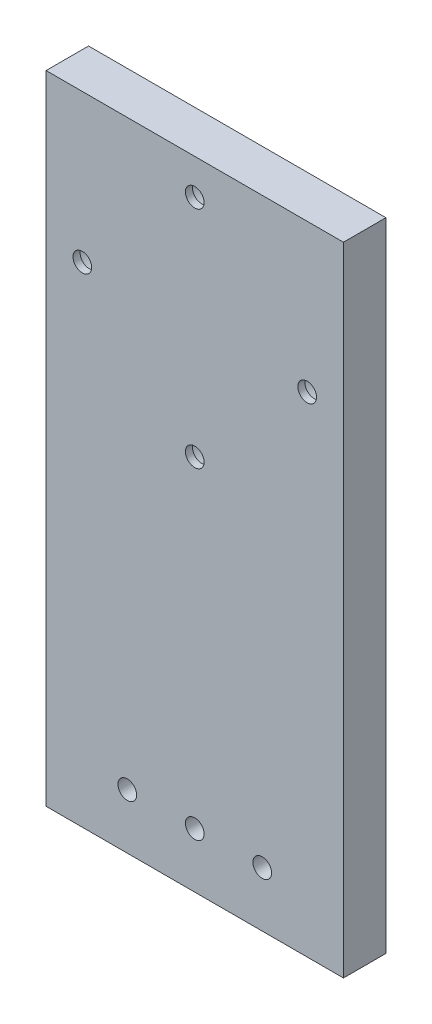
ISO-10303-21;
HEADER;
FILE_DESCRIPTION(('STEP AP214'),'2;1');
FILE_NAME('part.step','',(''),(''),'','','');
FILE_SCHEMA(('AUTOMOTIVE_DESIGN { 1 0 10303 214 1 1 1 1 }'));
ENDSEC;
DATA;
#1=APPLICATION_CONTEXT('core data for automotive mechanical design processes');
#2=APPLICATION_PROTOCOL_DEFINITION('international standard','automotive_design',2000,#1);
#3=PRODUCT_CONTEXT('',#1,'mechanical');
#4=PRODUCT('Part','Part','',(#3));
#5=PRODUCT_RELATED_PRODUCT_CATEGORY('part','',(#4));
#6=PRODUCT_DEFINITION_FORMATION('','',#4);
#7=PRODUCT_DEFINITION_CONTEXT('part definition',#1,'design');
#8=PRODUCT_DEFINITION('design','',#6,#7);
#9=PRODUCT_DEFINITION_SHAPE('','',#8);
#10=(LENGTH_UNIT() NAMED_UNIT(*) SI_UNIT(.MILLI.,.METRE.));
#11=(NAMED_UNIT(*) PLANE_ANGLE_UNIT() SI_UNIT($,.RADIAN.));
#12=(NAMED_UNIT(*) SI_UNIT($,.STERADIAN.) SOLID_ANGLE_UNIT());
#13=UNCERTAINTY_MEASURE_WITH_UNIT(LENGTH_MEASURE(1.E-05),#10,'distance_accuracy_value','');
#14=(GEOMETRIC_REPRESENTATION_CONTEXT(3) GLOBAL_UNCERTAINTY_ASSIGNED_CONTEXT((#13)) GLOBAL_UNIT_ASSIGNED_CONTEXT((#10,
#11,#12)) REPRESENTATION_CONTEXT('',''));
#15=CARTESIAN_POINT('',(0.,0.,0.));
#16=DIRECTION('',(0.,0.,1.));
#17=DIRECTION('',(1.,0.,0.));
#18=AXIS2_PLACEMENT_3D('',#15,#16,#17);
#19=CARTESIAN_POINT('',(0.,-15.875,6.));
#20=DIRECTION('',(0.,0.,-1.));
#21=DIRECTION('',(-1.,0.,0.));
#22=AXIS2_PLACEMENT_3D('',#19,#20,#21);
#23=CYLINDRICAL_SURFACE('',#22,1.32);
#24=CARTESIAN_POINT('',(0.,-15.875,6.));
#25=DIRECTION('',(0.,0.,1.));
#26=DIRECTION('',(1.,0.,0.));
#27=AXIS2_PLACEMENT_3D('',#24,#25,#26);
#28=CIRCLE('',#27,1.32);
#29=CARTESIAN_POINT('',(1.32,-15.875,6.));
#30=VERTEX_POINT('',#29);
#31=EDGE_CURVE('E104',#30,#30,#28,.T.);
#32=ORIENTED_EDGE('',*,*,#31,.T.);
#33=EDGE_LOOP('',(#32));
#34=FACE_BOUND('',#33,.T.);
#35=CARTESIAN_POINT('',(0.,-15.875,5.));
#36=DIRECTION('',(0.,0.,-1.));
#37=DIRECTION('',(-1.,0.,0.));
#38=AXIS2_PLACEMENT_3D('',#35,#36,#37);
#39=CIRCLE('',#38,1.32);
#40=CARTESIAN_POINT('',(-1.32,-15.875,5.));
#41=VERTEX_POINT('',#40);
#42=EDGE_CURVE('E37',#41,#41,#39,.T.);
#43=ORIENTED_EDGE('',*,*,#42,.T.);
#44=EDGE_LOOP('',(#43));
#45=FACE_BOUND('',#44,.T.);
#46=ADVANCED_FACE('F33',(#34,#45),#23,.F.);
#47=CARTESIAN_POINT('',(-15.875,0.,6.));
#48=DIRECTION('',(0.,0.,-1.));
#49=DIRECTION('',(-1.,0.,0.));
#50=AXIS2_PLACEMENT_3D('',#47,#48,#49);
#51=CYLINDRICAL_SURFACE('',#50,1.31999999999995);
#52=CARTESIAN_POINT('',(-15.875,0.,6.));
#53=DIRECTION('',(0.,0.,1.));
#54=DIRECTION('',(1.,0.,0.));
#55=AXIS2_PLACEMENT_3D('',#52,#53,#54);
#56=CIRCLE('',#55,1.31999999999995);
#57=CARTESIAN_POINT('',(-14.5550000000001,0.,6.));
#58=VERTEX_POINT('',#57);
#59=EDGE_CURVE('E161',#58,#58,#56,.T.);
#60=ORIENTED_EDGE('',*,*,#59,.T.);
#61=EDGE_LOOP('',(#60));
#62=FACE_BOUND('',#61,.T.);
#63=CARTESIAN_POINT('',(-15.875,0.,5.));
#64=DIRECTION('',(0.,0.,-1.));
#65=DIRECTION('',(-1.,0.,0.));
#66=AXIS2_PLACEMENT_3D('',#63,#64,#65);
#67=CIRCLE('',#66,1.31999999999995);
#68=CARTESIAN_POINT('',(-17.1949999999999,0.,5.));
#69=VERTEX_POINT('',#68);
#70=EDGE_CURVE('E119',#69,#69,#67,.T.);
#71=ORIENTED_EDGE('',*,*,#70,.T.);
#72=EDGE_LOOP('',(#71));
#73=FACE_BOUND('',#72,.T.);
#74=ADVANCED_FACE('F205',(#62,#73),#51,.F.);
#75=CARTESIAN_POINT('',(1.08910405714623E-13,15.875,6.));
#76=DIRECTION('',(0.,0.,-1.));
#77=DIRECTION('',(-1.,0.,0.));
#78=AXIS2_PLACEMENT_3D('',#75,#76,#77);
#79=CYLINDRICAL_SURFACE('',#78,1.32);
#80=CARTESIAN_POINT('',(1.08910405714623E-13,15.875,6.));
#81=DIRECTION('',(0.,0.,1.));
#82=DIRECTION('',(1.,0.,0.));
#83=AXIS2_PLACEMENT_3D('',#80,#81,#82);
#84=CIRCLE('',#83,1.32);
#85=CARTESIAN_POINT('',(1.32000000000011,15.875,6.));
#86=VERTEX_POINT('',#85);
#87=EDGE_CURVE('E158',#86,#86,#84,.T.);
#88=ORIENTED_EDGE('',*,*,#87,.T.);
#89=EDGE_LOOP('',(#88));
#90=FACE_BOUND('',#89,.T.);
#91=CARTESIAN_POINT('',(1.08910405714623E-13,15.875,5.));
#92=DIRECTION('',(0.,0.,-1.));
#93=DIRECTION('',(-1.,0.,0.));
#94=AXIS2_PLACEMENT_3D('',#91,#92,#93);
#95=CIRCLE('',#94,1.32);
#96=CARTESIAN_POINT('',(-1.31999999999989,15.875,5.));
#97=VERTEX_POINT('',#96);
#98=EDGE_CURVE('E115',#97,#97,#95,.T.);
#99=ORIENTED_EDGE('',*,*,#98,.T.);
#100=EDGE_LOOP('',(#99));
#101=FACE_BOUND('',#100,.T.);
#102=ADVANCED_FACE('F210',(#90,#101),#79,.F.);
#103=CARTESIAN_POINT('',(15.875,0.,6.));
#104=DIRECTION('',(0.,0.,-1.));
#105=DIRECTION('',(-1.,0.,0.));
#106=AXIS2_PLACEMENT_3D('',#103,#104,#105);
#107=CYLINDRICAL_SURFACE('',#106,1.31999999999984);
#108=CARTESIAN_POINT('',(15.875,0.,6.));
#109=DIRECTION('',(0.,0.,1.));
#110=DIRECTION('',(1.,0.,0.));
#111=AXIS2_PLACEMENT_3D('',#108,#109,#110);
#112=CIRCLE('',#111,1.31999999999984);
#113=CARTESIAN_POINT('',(17.1949999999998,0.,6.));
#114=VERTEX_POINT('',#113);
#115=EDGE_CURVE('E153',#114,#114,#112,.T.);
#116=ORIENTED_EDGE('',*,*,#115,.T.);
#117=EDGE_LOOP('',(#116));
#118=FACE_BOUND('',#117,.T.);
#119=CARTESIAN_POINT('',(15.875,0.,5.));
#120=DIRECTION('',(0.,0.,-1.));
#121=DIRECTION('',(-1.,0.,0.));
#122=AXIS2_PLACEMENT_3D('',#119,#120,#121);
#123=CIRCLE('',#122,1.31999999999984);
#124=CARTESIAN_POINT('',(14.5550000000002,0.,5.));
#125=VERTEX_POINT('',#124);
#126=EDGE_CURVE('E110',#125,#125,#123,.T.);
#127=ORIENTED_EDGE('',*,*,#126,.T.);
#128=EDGE_LOOP('',(#127));
#129=FACE_BOUND('',#128,.T.);
#130=ADVANCED_FACE('F177',(#118,#129),#107,.F.);
#131=CARTESIAN_POINT('',(0.,0.,6.));
#132=DIRECTION('',(0.,0.,1.));
#133=DIRECTION('',(1.,0.,0.));
#134=AXIS2_PLACEMENT_3D('',#131,#132,#133);
#135=PLANE('',#134);
#136=CARTESIAN_POINT('',(0.,-61.35,6.));
#137=DIRECTION('',(0.,0.,1.));
#138=DIRECTION('',(1.,0.,0.));
#139=AXIS2_PLACEMENT_3D('',#136,#137,#138);
#140=CIRCLE('',#139,1.32);
#141=CARTESIAN_POINT('',(1.32,-61.35,6.));
#142=VERTEX_POINT('',#141);
#143=EDGE_CURVE('E150',#142,#142,#140,.T.);
#144=ORIENTED_EDGE('',*,*,#143,.F.);
#145=EDGE_LOOP('',(#144));
#146=FACE_BOUND('',#145,.T.);
#147=ORIENTED_EDGE('',*,*,#87,.F.);
#148=EDGE_LOOP('',(#147));
#149=FACE_BOUND('',#148,.T.);
#150=CARTESIAN_POINT('',(-9.52999999999999,-61.35,6.));
#151=DIRECTION('',(0.,0.,1.));
#152=DIRECTION('',(1.,0.,0.));
#153=AXIS2_PLACEMENT_3D('',#150,#151,#152);
#154=CIRCLE('',#153,1.32);
#155=CARTESIAN_POINT('',(-8.20999999999999,-61.35,6.));
#156=VERTEX_POINT('',#155);
#157=EDGE_CURVE('E165',#156,#156,#154,.T.);
#158=ORIENTED_EDGE('',*,*,#157,.F.);
#159=EDGE_LOOP('',(#158));
#160=FACE_BOUND('',#159,.T.);
#161=DIRECTION('',(0.,-1.,0.));
#162=VECTOR('',#161,1.);
#163=CARTESIAN_POINT('',(-21.,20.875,6.));
#164=LINE('',#163,#162);
#165=CARTESIAN_POINT('',(-21.,20.875,6.));
#166=VERTEX_POINT('',#165);
#167=CARTESIAN_POINT('',(-21.,-69.125,6.));
#168=VERTEX_POINT('',#167);
#169=EDGE_CURVE('E88',#166,#168,#164,.T.);
#170=ORIENTED_EDGE('',*,*,#169,.T.);
#171=DIRECTION('',(1.,0.,0.));
#172=VECTOR('',#171,1.);
#173=CARTESIAN_POINT('',(-21.,-69.125,6.));
#174=LINE('',#173,#172);
#175=CARTESIAN_POINT('',(21.,-69.125,6.));
#176=VERTEX_POINT('',#175);
#177=EDGE_CURVE('E82',#168,#176,#174,.T.);
#178=ORIENTED_EDGE('',*,*,#177,.T.);
#179=DIRECTION('',(0.,1.,0.));
#180=VECTOR('',#179,1.);
#181=CARTESIAN_POINT('',(21.,20.875,6.));
#182=LINE('',#181,#180);
#183=CARTESIAN_POINT('',(21.,20.875,6.));
#184=VERTEX_POINT('',#183);
#185=EDGE_CURVE('E86',#176,#184,#182,.T.);
#186=ORIENTED_EDGE('',*,*,#185,.T.);
#187=DIRECTION('',(-1.,0.,0.));
#188=VECTOR('',#187,1.);
#189=CARTESIAN_POINT('',(-21.,20.875,6.));
#190=LINE('',#189,#188);
#191=EDGE_CURVE('E52',#184,#166,#190,.T.);
#192=ORIENTED_EDGE('',*,*,#191,.T.);
#193=EDGE_LOOP('',(#170,#178,#186,#192));
#194=FACE_BOUND('',#193,.T.);
#195=ORIENTED_EDGE('',*,*,#31,.F.);
#196=EDGE_LOOP('',(#195));
#197=FACE_BOUND('',#196,.T.);
#198=ORIENTED_EDGE('',*,*,#59,.F.);
#199=EDGE_LOOP('',(#198));
#200=FACE_BOUND('',#199,.T.);
#201=ORIENTED_EDGE('',*,*,#115,.F.);
#202=EDGE_LOOP('',(#201));
#203=FACE_BOUND('',#202,.T.);
#204=CARTESIAN_POINT('',(9.53,-61.35,6.));
#205=DIRECTION('',(0.,0.,1.));
#206=DIRECTION('',(1.,0.,0.));
#207=AXIS2_PLACEMENT_3D('',#204,#205,#206);
#208=CIRCLE('',#207,1.32);
#209=CARTESIAN_POINT('',(10.85,-61.35,6.));
#210=VERTEX_POINT('',#209);
#211=EDGE_CURVE('E144',#210,#210,#208,.T.);
#212=ORIENTED_EDGE('',*,*,#211,.F.);
#213=EDGE_LOOP('',(#212));
#214=FACE_BOUND('',#213,.T.);
#215=ADVANCED_FACE('F83',(#146,#149,#160,#194,#197,#200,#203,#214),#135,.T.);
#216=CARTESIAN_POINT('',(0.,0.,0.));
#217=DIRECTION('',(0.,0.,1.));
#218=DIRECTION('',(1.,0.,0.));
#219=AXIS2_PLACEMENT_3D('',#216,#217,#218);
#220=PLANE('',#219);
#221=CARTESIAN_POINT('',(0.,-15.8749999999999,0.));
#222=DIRECTION('',(0.,0.,-1.));
#223=DIRECTION('',(-1.,0.,0.));
#224=AXIS2_PLACEMENT_3D('',#221,#222,#223);
#225=CIRCLE('',#224,3.25);
#226=CARTESIAN_POINT('',(-3.24999999999999,-15.8749999999999,0.));
#227=VERTEX_POINT('',#226);
#228=EDGE_CURVE('E135',#227,#227,#225,.T.);
#229=ORIENTED_EDGE('',*,*,#228,.F.);
#230=EDGE_LOOP('',(#229));
#231=FACE_BOUND('',#230,.T.);
#232=CARTESIAN_POINT('',(-15.8749999999999,1.09107160968774E-13,0.));
#233=DIRECTION('',(0.,0.,-1.));
#234=DIRECTION('',(-1.,0.,0.));
#235=AXIS2_PLACEMENT_3D('',#232,#233,#234);
#236=CIRCLE('',#235,3.25);
#237=CARTESIAN_POINT('',(-19.1249999999999,1.09107160968774E-13,0.));
#238=VERTEX_POINT('',#237);
#239=EDGE_CURVE('E128',#238,#238,#236,.T.);
#240=ORIENTED_EDGE('',*,*,#239,.F.);
#241=EDGE_LOOP('',(#240));
#242=FACE_BOUND('',#241,.T.);
#243=CARTESIAN_POINT('',(1.08910405714623E-13,15.875,0.));
#244=DIRECTION('',(0.,0.,-1.));
#245=DIRECTION('',(-1.,0.,0.));
#246=AXIS2_PLACEMENT_3D('',#243,#244,#245);
#247=CIRCLE('',#246,3.25);
#248=CARTESIAN_POINT('',(-3.24999999999989,15.875,0.));
#249=VERTEX_POINT('',#248);
#250=EDGE_CURVE('E121',#249,#249,#247,.T.);
#251=ORIENTED_EDGE('',*,*,#250,.F.);
#252=EDGE_LOOP('',(#251));
#253=FACE_BOUND('',#252,.T.);
#254=CARTESIAN_POINT('',(15.875,0.,0.));
#255=DIRECTION('',(0.,0.,-1.));
#256=DIRECTION('',(-1.,0.,0.));
#257=AXIS2_PLACEMENT_3D('',#254,#255,#256);
#258=CIRCLE('',#257,3.25);
#259=CARTESIAN_POINT('',(12.625,0.,0.));
#260=VERTEX_POINT('',#259);
#261=EDGE_CURVE('E117',#260,#260,#258,.T.);
#262=ORIENTED_EDGE('',*,*,#261,.F.);
#263=EDGE_LOOP('',(#262));
#264=FACE_BOUND('',#263,.T.);
#265=CARTESIAN_POINT('',(0.,-61.35,0.));
#266=DIRECTION('',(0.,0.,1.));
#267=DIRECTION('',(1.,0.,0.));
#268=AXIS2_PLACEMENT_3D('',#265,#266,#267);
#269=CIRCLE('',#268,1.32);
#270=CARTESIAN_POINT('',(1.32,-61.35,0.));
#271=VERTEX_POINT('',#270);
#272=EDGE_CURVE('E147',#271,#271,#269,.T.);
#273=ORIENTED_EDGE('',*,*,#272,.T.);
#274=EDGE_LOOP('',(#273));
#275=FACE_BOUND('',#274,.T.);
#276=CARTESIAN_POINT('',(-9.52999999999999,-61.35,0.));
#277=DIRECTION('',(0.,0.,1.));
#278=DIRECTION('',(1.,0.,0.));
#279=AXIS2_PLACEMENT_3D('',#276,#277,#278);
#280=CIRCLE('',#279,1.32);
#281=CARTESIAN_POINT('',(-8.20999999999999,-61.35,0.));
#282=VERTEX_POINT('',#281);
#283=EDGE_CURVE('E164',#282,#282,#280,.T.);
#284=ORIENTED_EDGE('',*,*,#283,.T.);
#285=EDGE_LOOP('',(#284));
#286=FACE_BOUND('',#285,.T.);
#287=DIRECTION('',(0.,-1.,0.));
#288=VECTOR('',#287,1.);
#289=CARTESIAN_POINT('',(-21.,20.875,0.));
#290=LINE('',#289,#288);
#291=CARTESIAN_POINT('',(-21.,20.875,0.));
#292=VERTEX_POINT('',#291);
#293=CARTESIAN_POINT('',(-21.,-69.125,0.));
#294=VERTEX_POINT('',#293);
#295=EDGE_CURVE('E101',#292,#294,#290,.T.);
#296=ORIENTED_EDGE('',*,*,#295,.F.);
#297=DIRECTION('',(-1.,0.,0.));
#298=VECTOR('',#297,1.);
#299=CARTESIAN_POINT('',(-21.,20.875,0.));
#300=LINE('',#299,#298);
#301=CARTESIAN_POINT('',(21.,20.875,0.));
#302=VERTEX_POINT('',#301);
#303=EDGE_CURVE('E75',#302,#292,#300,.T.);
#304=ORIENTED_EDGE('',*,*,#303,.F.);
#305=DIRECTION('',(0.,1.,0.));
#306=VECTOR('',#305,1.);
#307=CARTESIAN_POINT('',(21.,20.875,0.));
#308=LINE('',#307,#306);
#309=CARTESIAN_POINT('',(21.,-69.125,0.));
#310=VERTEX_POINT('',#309);
#311=EDGE_CURVE('E69',#310,#302,#308,.T.);
#312=ORIENTED_EDGE('',*,*,#311,.F.);
#313=DIRECTION('',(1.,0.,0.));
#314=VECTOR('',#313,1.);
#315=CARTESIAN_POINT('',(-21.,-69.125,0.));
#316=LINE('',#315,#314);
#317=EDGE_CURVE('E92',#294,#310,#316,.T.);
#318=ORIENTED_EDGE('',*,*,#317,.F.);
#319=EDGE_LOOP('',(#296,#304,#312,#318));
#320=FACE_BOUND('',#319,.T.);
#321=CARTESIAN_POINT('',(9.53,-61.35,0.));
#322=DIRECTION('',(0.,0.,1.));
#323=DIRECTION('',(1.,0.,0.));
#324=AXIS2_PLACEMENT_3D('',#321,#322,#323);
#325=CIRCLE('',#324,1.32);
#326=CARTESIAN_POINT('',(10.85,-61.35,0.));
#327=VERTEX_POINT('',#326);
#328=EDGE_CURVE('E113',#327,#327,#325,.T.);
#329=ORIENTED_EDGE('',*,*,#328,.T.);
#330=EDGE_LOOP('',(#329));
#331=FACE_BOUND('',#330,.T.);
#332=ADVANCED_FACE('F176',(#231,#242,#253,#264,#275,#286,#320,#331),#220,.F.);
#333=CARTESIAN_POINT('',(-21.,20.875,6.));
#334=DIRECTION('',(1.,0.,0.));
#335=DIRECTION('',(0.,1.,0.));
#336=AXIS2_PLACEMENT_3D('',#333,#334,#335);
#337=PLANE('',#336);
#338=ORIENTED_EDGE('',*,*,#295,.T.);
#339=DIRECTION('',(0.,0.,-1.));
#340=VECTOR('',#339,1.);
#341=CARTESIAN_POINT('',(-21.,-69.125,6.));
#342=LINE('',#341,#340);
#343=EDGE_CURVE('E11',#168,#294,#342,.T.);
#344=ORIENTED_EDGE('',*,*,#343,.F.);
#345=ORIENTED_EDGE('',*,*,#169,.F.);
#346=DIRECTION('',(0.,0.,-1.));
#347=VECTOR('',#346,1.);
#348=CARTESIAN_POINT('',(-21.,20.875,6.));
#349=LINE('',#348,#347);
#350=EDGE_CURVE('E97',#166,#292,#349,.T.);
#351=ORIENTED_EDGE('',*,*,#350,.T.);
#352=EDGE_LOOP('',(#338,#344,#345,#351));
#353=FACE_BOUND('',#352,.T.);
#354=ADVANCED_FACE('F35',(#353),#337,.F.);
#355=CARTESIAN_POINT('',(-21.,-69.125,6.));
#356=DIRECTION('',(0.,1.,0.));
#357=DIRECTION('',(0.,0.,1.));
#358=AXIS2_PLACEMENT_3D('',#355,#356,#357);
#359=PLANE('',#358);
#360=ORIENTED_EDGE('',*,*,#317,.T.);
#361=DIRECTION('',(0.,0.,-1.));
#362=VECTOR('',#361,1.);
#363=CARTESIAN_POINT('',(21.,-69.125,6.));
#364=LINE('',#363,#362);
#365=EDGE_CURVE('E43',#176,#310,#364,.T.);
#366=ORIENTED_EDGE('',*,*,#365,.F.);
#367=ORIENTED_EDGE('',*,*,#177,.F.);
#368=ORIENTED_EDGE('',*,*,#343,.T.);
#369=EDGE_LOOP('',(#360,#366,#367,#368));
#370=FACE_BOUND('',#369,.T.);
#371=ADVANCED_FACE('F91',(#370),#359,.F.);
#372=CARTESIAN_POINT('',(21.,20.875,6.));
#373=DIRECTION('',(-1.,0.,0.));
#374=DIRECTION('',(0.,-1.,0.));
#375=AXIS2_PLACEMENT_3D('',#372,#373,#374);
#376=PLANE('',#375);
#377=ORIENTED_EDGE('',*,*,#311,.T.);
#378=DIRECTION('',(0.,0.,-1.));
#379=VECTOR('',#378,1.);
#380=CARTESIAN_POINT('',(21.,20.875,6.));
#381=LINE('',#380,#379);
#382=EDGE_CURVE('E93',#184,#302,#381,.T.);
#383=ORIENTED_EDGE('',*,*,#382,.F.);
#384=ORIENTED_EDGE('',*,*,#185,.F.);
#385=ORIENTED_EDGE('',*,*,#365,.T.);
#386=EDGE_LOOP('',(#377,#383,#384,#385));
#387=FACE_BOUND('',#386,.T.);
#388=ADVANCED_FACE('F95',(#387),#376,.F.);
#389=CARTESIAN_POINT('',(-21.,20.875,6.));
#390=DIRECTION('',(0.,-1.,0.));
#391=DIRECTION('',(1.,0.,0.));
#392=AXIS2_PLACEMENT_3D('',#389,#390,#391);
#393=PLANE('',#392);
#394=ORIENTED_EDGE('',*,*,#303,.T.);
#395=ORIENTED_EDGE('',*,*,#350,.F.);
#396=ORIENTED_EDGE('',*,*,#191,.F.);
#397=ORIENTED_EDGE('',*,*,#382,.T.);
#398=EDGE_LOOP('',(#394,#395,#396,#397));
#399=FACE_BOUND('',#398,.T.);
#400=ADVANCED_FACE('F216',(#399),#393,.F.);
#401=CARTESIAN_POINT('',(-9.52999999999999,-61.35,6.));
#402=DIRECTION('',(0.,0.,-1.));
#403=DIRECTION('',(-1.,0.,0.));
#404=AXIS2_PLACEMENT_3D('',#401,#402,#403);
#405=CYLINDRICAL_SURFACE('',#404,1.32);
#406=ORIENTED_EDGE('',*,*,#157,.T.);
#407=EDGE_LOOP('',(#406));
#408=FACE_BOUND('',#407,.T.);
#409=ORIENTED_EDGE('',*,*,#283,.F.);
#410=EDGE_LOOP('',(#409));
#411=FACE_BOUND('',#410,.T.);
#412=ADVANCED_FACE('F214',(#408,#411),#405,.F.);
#413=CARTESIAN_POINT('',(0.,-61.35,6.));
#414=DIRECTION('',(0.,0.,-1.));
#415=DIRECTION('',(-1.,0.,0.));
#416=AXIS2_PLACEMENT_3D('',#413,#414,#415);
#417=CYLINDRICAL_SURFACE('',#416,1.32);
#418=ORIENTED_EDGE('',*,*,#143,.T.);
#419=EDGE_LOOP('',(#418));
#420=FACE_BOUND('',#419,.T.);
#421=ORIENTED_EDGE('',*,*,#272,.F.);
#422=EDGE_LOOP('',(#421));
#423=FACE_BOUND('',#422,.T.);
#424=ADVANCED_FACE('F190',(#420,#423),#417,.F.);
#425=CARTESIAN_POINT('',(9.53,-61.35,6.));
#426=DIRECTION('',(0.,0.,-1.));
#427=DIRECTION('',(-1.,0.,0.));
#428=AXIS2_PLACEMENT_3D('',#425,#426,#427);
#429=CYLINDRICAL_SURFACE('',#428,1.32);
#430=ORIENTED_EDGE('',*,*,#211,.T.);
#431=EDGE_LOOP('',(#430));
#432=FACE_BOUND('',#431,.T.);
#433=ORIENTED_EDGE('',*,*,#328,.F.);
#434=EDGE_LOOP('',(#433));
#435=FACE_BOUND('',#434,.T.);
#436=ADVANCED_FACE('F186',(#432,#435),#429,.F.);
#437=CARTESIAN_POINT('',(15.875,0.,5.));
#438=DIRECTION('',(0.,0.,-1.));
#439=DIRECTION('',(-1.,0.,0.));
#440=AXIS2_PLACEMENT_3D('',#437,#438,#439);
#441=CYLINDRICAL_SURFACE('',#440,3.25);
#442=CARTESIAN_POINT('',(15.875,0.,5.));
#443=DIRECTION('',(0.,0.,-1.));
#444=DIRECTION('',(-1.,0.,0.));
#445=AXIS2_PLACEMENT_3D('',#442,#443,#444);
#446=CIRCLE('',#445,3.25);
#447=CARTESIAN_POINT('',(12.625,0.,5.));
#448=VERTEX_POINT('',#447);
#449=EDGE_CURVE('E114',#448,#448,#446,.T.);
#450=ORIENTED_EDGE('',*,*,#449,.F.);
#451=EDGE_LOOP('',(#450));
#452=FACE_BOUND('',#451,.T.);
#453=ORIENTED_EDGE('',*,*,#261,.T.);
#454=EDGE_LOOP('',(#453));
#455=FACE_BOUND('',#454,.T.);
#456=ADVANCED_FACE('F189',(#452,#455),#441,.F.);
#457=CARTESIAN_POINT('',(15.875,0.,5.));
#458=DIRECTION('',(0.,0.,-1.));
#459=DIRECTION('',(-1.,0.,0.));
#460=AXIS2_PLACEMENT_3D('',#457,#458,#459);
#461=PLANE('',#460);
#462=ORIENTED_EDGE('',*,*,#126,.F.);
#463=EDGE_LOOP('',(#462));
#464=FACE_BOUND('',#463,.T.);
#465=ORIENTED_EDGE('',*,*,#449,.T.);
#466=EDGE_LOOP('',(#465));
#467=FACE_BOUND('',#466,.T.);
#468=ADVANCED_FACE('F230',(#464,#467),#461,.T.);
#469=CARTESIAN_POINT('',(1.08910405714623E-13,15.875,5.));
#470=DIRECTION('',(0.,0.,-1.));
#471=DIRECTION('',(-1.,0.,0.));
#472=AXIS2_PLACEMENT_3D('',#469,#470,#471);
#473=CYLINDRICAL_SURFACE('',#472,3.25);
#474=CARTESIAN_POINT('',(1.08910405714623E-13,15.875,5.));
#475=DIRECTION('',(0.,0.,-1.));
#476=DIRECTION('',(-1.,0.,0.));
#477=AXIS2_PLACEMENT_3D('',#474,#475,#476);
#478=CIRCLE('',#477,3.25);
#479=CARTESIAN_POINT('',(-3.24999999999989,15.875,5.));
#480=VERTEX_POINT('',#479);
#481=EDGE_CURVE('E118',#480,#480,#478,.T.);
#482=ORIENTED_EDGE('',*,*,#481,.F.);
#483=EDGE_LOOP('',(#482));
#484=FACE_BOUND('',#483,.T.);
#485=ORIENTED_EDGE('',*,*,#250,.T.);
#486=EDGE_LOOP('',(#485));
#487=FACE_BOUND('',#486,.T.);
#488=ADVANCED_FACE('F234',(#484,#487),#473,.F.);
#489=CARTESIAN_POINT('',(1.08910405714623E-13,15.875,5.));
#490=DIRECTION('',(0.,0.,-1.));
#491=DIRECTION('',(-1.,0.,0.));
#492=AXIS2_PLACEMENT_3D('',#489,#490,#491);
#493=PLANE('',#492);
#494=ORIENTED_EDGE('',*,*,#98,.F.);
#495=EDGE_LOOP('',(#494));
#496=FACE_BOUND('',#495,.T.);
#497=ORIENTED_EDGE('',*,*,#481,.T.);
#498=EDGE_LOOP('',(#497));
#499=FACE_BOUND('',#498,.T.);
#500=ADVANCED_FACE('F238',(#496,#499),#493,.T.);
#501=CARTESIAN_POINT('',(-15.8749999999999,1.09107160968774E-13,5.));
#502=DIRECTION('',(0.,0.,-1.));
#503=DIRECTION('',(-1.,0.,0.));
#504=AXIS2_PLACEMENT_3D('',#501,#502,#503);
#505=CYLINDRICAL_SURFACE('',#504,3.25);
#506=CARTESIAN_POINT('',(-15.8749999999999,1.09107160968774E-13,5.));
#507=DIRECTION('',(0.,0.,-1.));
#508=DIRECTION('',(-1.,0.,0.));
#509=AXIS2_PLACEMENT_3D('',#506,#507,#508);
#510=CIRCLE('',#509,3.25);
#511=CARTESIAN_POINT('',(-19.1249999999999,1.09107160968774E-13,5.));
#512=VERTEX_POINT('',#511);
#513=EDGE_CURVE('E122',#512,#512,#510,.T.);
#514=ORIENTED_EDGE('',*,*,#513,.F.);
#515=EDGE_LOOP('',(#514));
#516=FACE_BOUND('',#515,.T.);
#517=ORIENTED_EDGE('',*,*,#239,.T.);
#518=EDGE_LOOP('',(#517));
#519=FACE_BOUND('',#518,.T.);
#520=ADVANCED_FACE('F242',(#516,#519),#505,.F.);
#521=CARTESIAN_POINT('',(-15.8749999999999,1.09107160968774E-13,5.));
#522=DIRECTION('',(0.,0.,-1.));
#523=DIRECTION('',(-1.,0.,0.));
#524=AXIS2_PLACEMENT_3D('',#521,#522,#523);
#525=PLANE('',#524);
#526=ORIENTED_EDGE('',*,*,#70,.F.);
#527=EDGE_LOOP('',(#526));
#528=FACE_BOUND('',#527,.T.);
#529=ORIENTED_EDGE('',*,*,#513,.T.);
#530=EDGE_LOOP('',(#529));
#531=FACE_BOUND('',#530,.T.);
#532=ADVANCED_FACE('F246',(#528,#531),#525,.T.);
#533=CARTESIAN_POINT('',(0.,-15.8749999999999,5.));
#534=DIRECTION('',(0.,0.,-1.));
#535=DIRECTION('',(-1.,0.,0.));
#536=AXIS2_PLACEMENT_3D('',#533,#534,#535);
#537=CYLINDRICAL_SURFACE('',#536,3.25);
#538=CARTESIAN_POINT('',(0.,-15.8749999999999,5.));
#539=DIRECTION('',(0.,0.,-1.));
#540=DIRECTION('',(-1.,0.,0.));
#541=AXIS2_PLACEMENT_3D('',#538,#539,#540);
#542=CIRCLE('',#541,3.25);
#543=CARTESIAN_POINT('',(-3.24999999999999,-15.8749999999999,5.));
#544=VERTEX_POINT('',#543);
#545=EDGE_CURVE('E265',#544,#544,#542,.T.);
#546=ORIENTED_EDGE('',*,*,#545,.F.);
#547=EDGE_LOOP('',(#546));
#548=FACE_BOUND('',#547,.T.);
#549=ORIENTED_EDGE('',*,*,#228,.T.);
#550=EDGE_LOOP('',(#549));
#551=FACE_BOUND('',#550,.T.);
#552=ADVANCED_FACE('F250',(#548,#551),#537,.F.);
#553=CARTESIAN_POINT('',(0.,-15.8749999999999,5.));
#554=DIRECTION('',(0.,0.,-1.));
#555=DIRECTION('',(-1.,0.,0.));
#556=AXIS2_PLACEMENT_3D('',#553,#554,#555);
#557=PLANE('',#556);
#558=ORIENTED_EDGE('',*,*,#42,.F.);
#559=EDGE_LOOP('',(#558));
#560=FACE_BOUND('',#559,.T.);
#561=ORIENTED_EDGE('',*,*,#545,.T.);
#562=EDGE_LOOP('',(#561));
#563=FACE_BOUND('',#562,.T.);
#564=ADVANCED_FACE('F254',(#560,#563),#557,.T.);
#565=CLOSED_SHELL('',(#46,#74,#102,#130,#215,#332,#354,#371,#388,#400,#412,#424,#436,#456,#468,
#488,#500,#520,#532,#552,#564));
#566=MANIFOLD_SOLID_BREP('B2',#565);
#567=ADVANCED_BREP_SHAPE_REPRESENTATION('',(#18,#566),#14);
#568=SHAPE_DEFINITION_REPRESENTATION(#9,#567);
ENDSEC;
END-ISO-10303-21;
